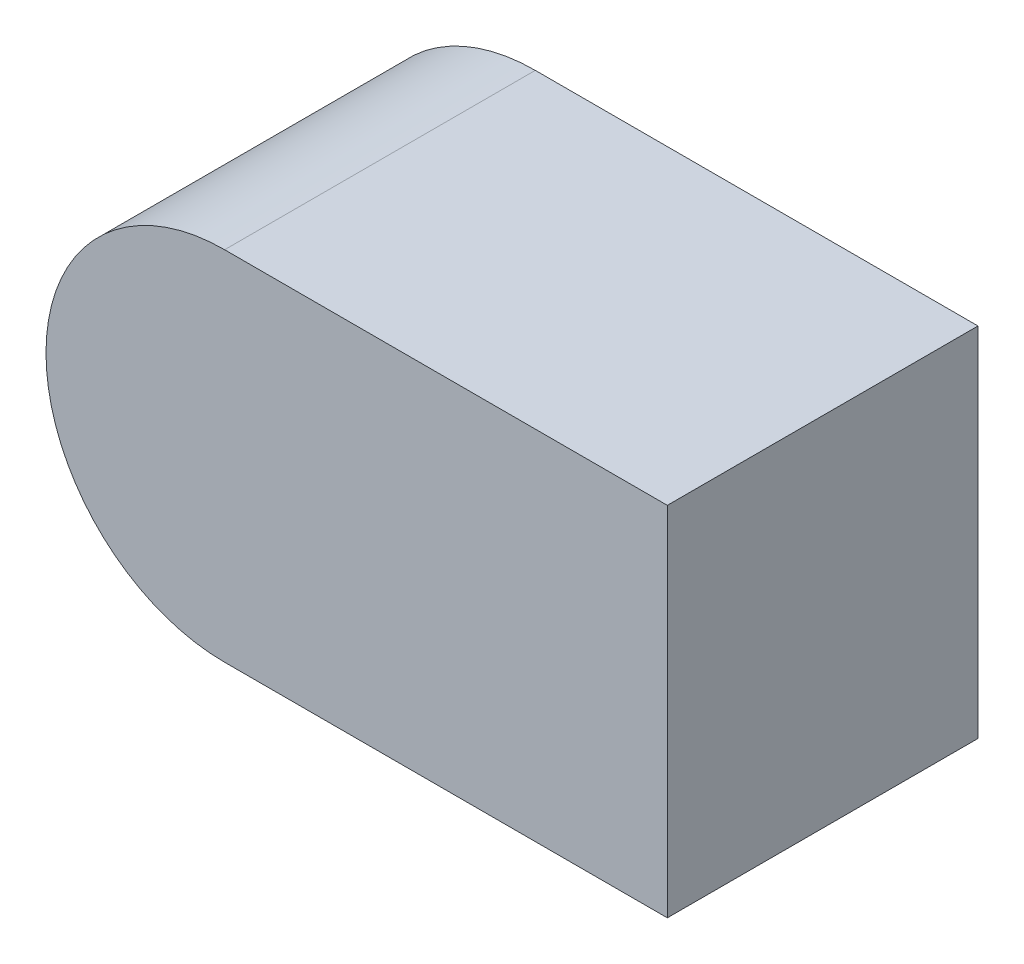
ISO-10303-21;
HEADER;
FILE_DESCRIPTION(('STEP AP214'),'2;1');
FILE_NAME('part.step','',(''),(''),'','','');
FILE_SCHEMA(('AUTOMOTIVE_DESIGN { 1 0 10303 214 1 1 1 1 }'));
ENDSEC;
DATA;
#1=APPLICATION_CONTEXT('core data for automotive mechanical design processes');
#2=APPLICATION_PROTOCOL_DEFINITION('international standard','automotive_design',2000,#1);
#3=PRODUCT_CONTEXT('',#1,'mechanical');
#4=PRODUCT('Part','Part','',(#3));
#5=PRODUCT_RELATED_PRODUCT_CATEGORY('part','',(#4));
#6=PRODUCT_DEFINITION_FORMATION('','',#4);
#7=PRODUCT_DEFINITION_CONTEXT('part definition',#1,'design');
#8=PRODUCT_DEFINITION('design','',#6,#7);
#9=PRODUCT_DEFINITION_SHAPE('','',#8);
#10=(LENGTH_UNIT() NAMED_UNIT(*) SI_UNIT(.MILLI.,.METRE.));
#11=(NAMED_UNIT(*) PLANE_ANGLE_UNIT() SI_UNIT($,.RADIAN.));
#12=(NAMED_UNIT(*) SI_UNIT($,.STERADIAN.) SOLID_ANGLE_UNIT());
#13=UNCERTAINTY_MEASURE_WITH_UNIT(LENGTH_MEASURE(1.E-05),#10,'distance_accuracy_value','');
#14=(GEOMETRIC_REPRESENTATION_CONTEXT(3) GLOBAL_UNCERTAINTY_ASSIGNED_CONTEXT((#13)) GLOBAL_UNIT_ASSIGNED_CONTEXT((#10,
#11,#12)) REPRESENTATION_CONTEXT('',''));
#15=CARTESIAN_POINT('',(0.,0.,0.));
#16=DIRECTION('',(0.,0.,1.));
#17=DIRECTION('',(1.,0.,0.));
#18=AXIS2_PLACEMENT_3D('',#15,#16,#17);
#19=CARTESIAN_POINT('',(2.8335240809167,-2.25,0.2));
#20=DIRECTION('',(0.,0.,1.));
#21=DIRECTION('',(1.,0.,0.));
#22=AXIS2_PLACEMENT_3D('',#19,#20,#21);
#23=PLANE('',#22);
#24=DIRECTION('',(1.,0.,0.));
#25=VECTOR('',#24,1.);
#26=CARTESIAN_POINT('',(2.715,-2.365,0.2));
#27=LINE('',#26,#25);
#28=CARTESIAN_POINT('',(2.715,-2.365,0.2));
#29=VERTEX_POINT('',#28);
#30=CARTESIAN_POINT('',(3.,-2.365,0.2));
#31=VERTEX_POINT('',#30);
#32=EDGE_CURVE('E11',#29,#31,#27,.T.);
#33=ORIENTED_EDGE('',*,*,#32,.T.);
#34=DIRECTION('',(0.,1.,0.));
#35=VECTOR('',#34,1.);
#36=CARTESIAN_POINT('',(3.,-2.625,0.2));
#37=LINE('',#36,#35);
#38=CARTESIAN_POINT('',(3.,-2.135,0.2));
#39=VERTEX_POINT('',#38);
#40=EDGE_CURVE('E24',#31,#39,#37,.T.);
#41=ORIENTED_EDGE('',*,*,#40,.T.);
#42=DIRECTION('',(-1.,0.,0.));
#43=VECTOR('',#42,1.);
#44=CARTESIAN_POINT('',(3.,-2.135,0.2));
#45=LINE('',#44,#43);
#46=CARTESIAN_POINT('',(2.715,-2.135,0.2));
#47=VERTEX_POINT('',#46);
#48=EDGE_CURVE('E88',#39,#47,#45,.T.);
#49=ORIENTED_EDGE('',*,*,#48,.T.);
#50=CARTESIAN_POINT('',(2.715,-2.25,0.2));
#51=DIRECTION('',(0.,0.,1.));
#52=DIRECTION('',(0.,1.,0.));
#53=AXIS2_PLACEMENT_3D('',#50,#51,#52);
#54=CIRCLE('',#53,0.115);
#55=EDGE_CURVE('E70',#47,#29,#54,.T.);
#56=ORIENTED_EDGE('',*,*,#55,.T.);
#57=EDGE_LOOP('',(#33,#41,#49,#56));
#58=FACE_BOUND('',#57,.T.);
#59=ADVANCED_FACE('F17',(#58),#23,.T.);
#60=CARTESIAN_POINT('',(3.,-3.,0.));
#61=DIRECTION('',(1.,0.,0.));
#62=DIRECTION('',(0.,1.,0.));
#63=AXIS2_PLACEMENT_3D('',#60,#61,#62);
#64=PLANE('',#63);
#65=DIRECTION('',(0.,0.,-1.));
#66=VECTOR('',#65,1.);
#67=CARTESIAN_POINT('',(3.,-2.135,0.));
#68=LINE('',#67,#66);
#69=CARTESIAN_POINT('',(3.,-2.135,0.));
#70=VERTEX_POINT('',#69);
#71=EDGE_CURVE('E76',#39,#70,#68,.T.);
#72=ORIENTED_EDGE('',*,*,#71,.F.);
#73=ORIENTED_EDGE('',*,*,#40,.F.);
#74=DIRECTION('',(0.,0.,1.));
#75=VECTOR('',#74,1.);
#76=CARTESIAN_POINT('',(3.,-2.365,0.));
#77=LINE('',#76,#75);
#78=CARTESIAN_POINT('',(3.,-2.365,0.));
#79=VERTEX_POINT('',#78);
#80=EDGE_CURVE('E84',#79,#31,#77,.T.);
#81=ORIENTED_EDGE('',*,*,#80,.F.);
#82=DIRECTION('',(0.,1.,0.));
#83=VECTOR('',#82,1.);
#84=CARTESIAN_POINT('',(3.,-2.365,0.));
#85=LINE('',#84,#83);
#86=EDGE_CURVE('E82',#79,#70,#85,.T.);
#87=ORIENTED_EDGE('',*,*,#86,.T.);
#88=EDGE_LOOP('',(#72,#73,#81,#87));
#89=FACE_BOUND('',#88,.T.);
#90=ADVANCED_FACE('F90',(#89),#64,.T.);
#91=CARTESIAN_POINT('',(2.715,-2.365,0.));
#92=DIRECTION('',(0.,-1.,0.));
#93=DIRECTION('',(1.,0.,0.));
#94=AXIS2_PLACEMENT_3D('',#91,#92,#93);
#95=PLANE('',#94);
#96=DIRECTION('',(1.,0.,0.));
#97=VECTOR('',#96,1.);
#98=CARTESIAN_POINT('',(2.715,-2.365,0.));
#99=LINE('',#98,#97);
#100=CARTESIAN_POINT('',(2.715,-2.365,0.));
#101=VERTEX_POINT('',#100);
#102=EDGE_CURVE('E61',#101,#79,#99,.T.);
#103=ORIENTED_EDGE('',*,*,#102,.T.);
#104=ORIENTED_EDGE('',*,*,#80,.T.);
#105=ORIENTED_EDGE('',*,*,#32,.F.);
#106=DIRECTION('',(0.,0.,1.));
#107=VECTOR('',#106,1.);
#108=CARTESIAN_POINT('',(2.715,-2.365,0.));
#109=LINE('',#108,#107);
#110=EDGE_CURVE('E64',#101,#29,#109,.T.);
#111=ORIENTED_EDGE('',*,*,#110,.F.);
#112=EDGE_LOOP('',(#103,#104,#105,#111));
#113=FACE_BOUND('',#112,.T.);
#114=ADVANCED_FACE('F91',(#113),#95,.T.);
#115=CARTESIAN_POINT('',(2.715,-2.25,0.));
#116=DIRECTION('',(0.,0.,1.));
#117=DIRECTION('',(0.,1.,0.));
#118=AXIS2_PLACEMENT_3D('',#115,#116,#117);
#119=CYLINDRICAL_SURFACE('',#118,0.115);
#120=CARTESIAN_POINT('',(2.715,-2.25,0.));
#121=DIRECTION('',(0.,0.,1.));
#122=DIRECTION('',(0.,1.,0.));
#123=AXIS2_PLACEMENT_3D('',#120,#121,#122);
#124=CIRCLE('',#123,0.115);
#125=CARTESIAN_POINT('',(2.715,-2.135,0.));
#126=VERTEX_POINT('',#125);
#127=EDGE_CURVE('E54',#126,#101,#124,.T.);
#128=ORIENTED_EDGE('',*,*,#127,.T.);
#129=ORIENTED_EDGE('',*,*,#110,.T.);
#130=ORIENTED_EDGE('',*,*,#55,.F.);
#131=DIRECTION('',(0.,0.,1.));
#132=VECTOR('',#131,1.);
#133=CARTESIAN_POINT('',(2.715,-2.135,0.));
#134=LINE('',#133,#132);
#135=EDGE_CURVE('E65',#126,#47,#134,.T.);
#136=ORIENTED_EDGE('',*,*,#135,.F.);
#137=EDGE_LOOP('',(#128,#129,#130,#136));
#138=FACE_BOUND('',#137,.T.);
#139=ADVANCED_FACE('F69',(#138),#119,.T.);
#140=CARTESIAN_POINT('',(3.,-2.135,0.));
#141=DIRECTION('',(0.,1.,0.));
#142=DIRECTION('',(-1.,0.,0.));
#143=AXIS2_PLACEMENT_3D('',#140,#141,#142);
#144=PLANE('',#143);
#145=DIRECTION('',(-1.,0.,0.));
#146=VECTOR('',#145,1.);
#147=CARTESIAN_POINT('',(3.,-2.135,0.));
#148=LINE('',#147,#146);
#149=EDGE_CURVE('E59',#70,#126,#148,.T.);
#150=ORIENTED_EDGE('',*,*,#149,.T.);
#151=ORIENTED_EDGE('',*,*,#135,.T.);
#152=ORIENTED_EDGE('',*,*,#48,.F.);
#153=ORIENTED_EDGE('',*,*,#71,.T.);
#154=EDGE_LOOP('',(#150,#151,#152,#153));
#155=FACE_BOUND('',#154,.T.);
#156=ADVANCED_FACE('F74',(#155),#144,.T.);
#157=CARTESIAN_POINT('',(2.8335265642716,-2.25,0.));
#158=DIRECTION('',(0.,0.,1.));
#159=DIRECTION('',(-1.,0.,0.));
#160=AXIS2_PLACEMENT_3D('',#157,#158,#159);
#161=PLANE('',#160);
#162=ORIENTED_EDGE('',*,*,#86,.F.);
#163=ORIENTED_EDGE('',*,*,#102,.F.);
#164=ORIENTED_EDGE('',*,*,#127,.F.);
#165=ORIENTED_EDGE('',*,*,#149,.F.);
#166=EDGE_LOOP('',(#162,#163,#164,#165));
#167=FACE_BOUND('',#166,.T.);
#168=ADVANCED_FACE('F57',(#167),#161,.F.);
#169=CLOSED_SHELL('',(#59,#90,#114,#139,#156,#168));
#170=MANIFOLD_SOLID_BREP('B1',#169);
#171=ADVANCED_BREP_SHAPE_REPRESENTATION('',(#18,#170),#14);
#172=SHAPE_DEFINITION_REPRESENTATION(#9,#171);
ENDSEC;
END-ISO-10303-21;
